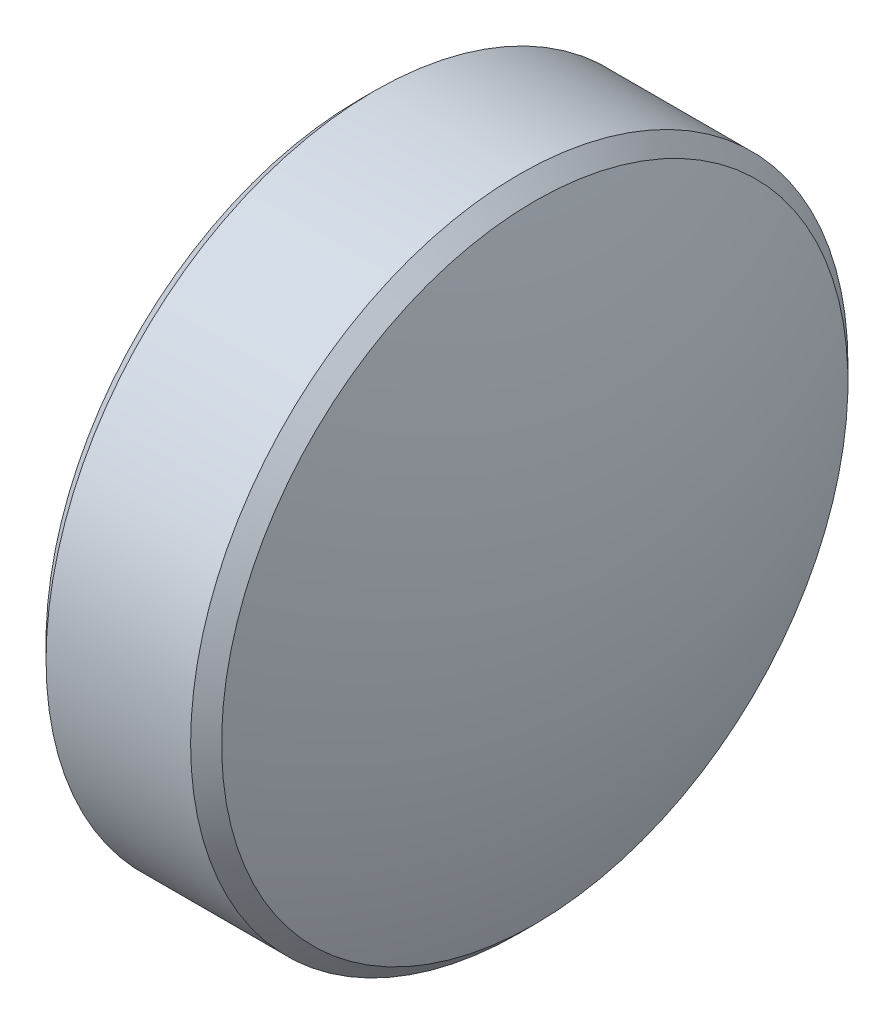
ISO-10303-21;
HEADER;
FILE_DESCRIPTION(('STEP AP214'),'2;1');
FILE_NAME('part.step','',(''),(''),'','','');
FILE_SCHEMA(('AUTOMOTIVE_DESIGN { 1 0 10303 214 1 1 1 1 }'));
ENDSEC;
DATA;
#1=APPLICATION_CONTEXT('core data for automotive mechanical design processes');
#2=APPLICATION_PROTOCOL_DEFINITION('international standard','automotive_design',2000,#1);
#3=PRODUCT_CONTEXT('',#1,'mechanical');
#4=PRODUCT('Part','Part','',(#3));
#5=PRODUCT_RELATED_PRODUCT_CATEGORY('part','',(#4));
#6=PRODUCT_DEFINITION_FORMATION('','',#4);
#7=PRODUCT_DEFINITION_CONTEXT('part definition',#1,'design');
#8=PRODUCT_DEFINITION('design','',#6,#7);
#9=PRODUCT_DEFINITION_SHAPE('','',#8);
#10=(LENGTH_UNIT() NAMED_UNIT(*) SI_UNIT(.MILLI.,.METRE.));
#11=(NAMED_UNIT(*) PLANE_ANGLE_UNIT() SI_UNIT($,.RADIAN.));
#12=(NAMED_UNIT(*) SI_UNIT($,.STERADIAN.) SOLID_ANGLE_UNIT());
#13=UNCERTAINTY_MEASURE_WITH_UNIT(LENGTH_MEASURE(1.E-05),#10,'distance_accuracy_value','');
#14=(GEOMETRIC_REPRESENTATION_CONTEXT(3) GLOBAL_UNCERTAINTY_ASSIGNED_CONTEXT((#13)) GLOBAL_UNIT_ASSIGNED_CONTEXT((#10,
#11,#12)) REPRESENTATION_CONTEXT('',''));
#15=CARTESIAN_POINT('',(0.,0.,0.));
#16=DIRECTION('',(0.,0.,1.));
#17=DIRECTION('',(1.,0.,0.));
#18=AXIS2_PLACEMENT_3D('',#15,#16,#17);
#19=CARTESIAN_POINT('',(7.49977537629818,0.0628754856546688,0.));
#20=DIRECTION('',(0.,0.,-1.));
#21=DIRECTION('',(0.,-1.,0.));
#22=AXIS2_PLACEMENT_3D('',#19,#20,#21);
#23=CIRCLE('',#22,8.8);
#24=TRIMMED_CURVE('',#23,(PARAMETER_VALUE(-1.56365132445006)),
(PARAMETER_VALUE(1.56365132445006)),.T.,.PARAMETER.);
#25=CARTESIAN_POINT('',(7.49977537629818,0.,0.));
#26=DIRECTION('',(-1.,0.,0.));
#27=AXIS1_PLACEMENT('',#25,#26);
#28=SURFACE_OF_REVOLUTION('',#24,#27);
#29=CARTESIAN_POINT('',(-1.3,0.,0.));
#30=VERTEX_POINT('',#29);
#31=VERTEX_LOOP('',#30);
#32=FACE_BOUND('',#31,.T.);
#33=CARTESIAN_POINT('',(-0.801134559950395,0.,0.));
#34=DIRECTION('',(-1.,0.,0.));
#35=DIRECTION('',(0.,-1.,0.));
#36=AXIS2_PLACEMENT_3D('',#33,#34,#35);
#37=CIRCLE('',#36,2.85857864376269);
#38=CARTESIAN_POINT('',(-0.801134559950394,-2.85857864376269,0.));
#39=VERTEX_POINT('',#38);
#40=EDGE_CURVE('E10',#39,#39,#37,.T.);
#41=ORIENTED_EDGE('',*,*,#40,.T.);
#42=EDGE_LOOP('',(#41));
#43=FACE_BOUND('',#42,.T.);
#44=ADVANCED_FACE('F15',(#32,#43),#28,.T.);
#45=CARTESIAN_POINT('',(-0.659713203713086,0.,0.));
#46=DIRECTION('',(1.,0.,0.));
#47=DIRECTION('',(0.,1.,0.));
#48=AXIS2_PLACEMENT_3D('',#45,#46,#47);
#49=CONICAL_SURFACE('',#48,3.,0.78539816339745);
#50=ORIENTED_EDGE('',*,*,#40,.F.);
#51=EDGE_LOOP('',(#50));
#52=FACE_BOUND('',#51,.T.);
#53=CARTESIAN_POINT('',(-0.659713203713086,0.,0.));
#54=DIRECTION('',(-1.,0.,0.));
#55=DIRECTION('',(0.,-1.,0.));
#56=AXIS2_PLACEMENT_3D('',#53,#54,#55);
#57=CIRCLE('',#56,3.);
#58=CARTESIAN_POINT('',(-0.659713203713085,-3.,0.));
#59=VERTEX_POINT('',#58);
#60=EDGE_CURVE('E22',#59,#59,#57,.T.);
#61=ORIENTED_EDGE('',*,*,#60,.T.);
#62=EDGE_LOOP('',(#61));
#63=FACE_BOUND('',#62,.T.);
#64=ADVANCED_FACE('F30',(#52,#63),#49,.T.);
#65=CARTESIAN_POINT('',(-1.3,0.,0.));
#66=DIRECTION('',(-1.,0.,0.));
#67=DIRECTION('',(0.,-1.,0.));
#68=AXIS2_PLACEMENT_3D('',#65,#66,#67);
#69=CYLINDRICAL_SURFACE('',#68,3.);
#70=ORIENTED_EDGE('',*,*,#60,.F.);
#71=EDGE_LOOP('',(#70));
#72=FACE_BOUND('',#71,.T.);
#73=CARTESIAN_POINT('',(0.659713203713087,0.,0.));
#74=DIRECTION('',(-1.,0.,0.));
#75=DIRECTION('',(0.,-1.,0.));
#76=AXIS2_PLACEMENT_3D('',#73,#74,#75);
#77=CIRCLE('',#76,3.);
#78=CARTESIAN_POINT('',(0.659713203713087,-3.,0.));
#79=VERTEX_POINT('',#78);
#80=EDGE_CURVE('E39',#79,#79,#77,.T.);
#81=ORIENTED_EDGE('',*,*,#80,.T.);
#82=EDGE_LOOP('',(#81));
#83=FACE_BOUND('',#82,.T.);
#84=ADVANCED_FACE('F35',(#72,#83),#69,.T.);
#85=CARTESIAN_POINT('',(0.801134559950394,0.,0.));
#86=DIRECTION('',(-1.,0.,0.));
#87=DIRECTION('',(0.,-1.,0.));
#88=AXIS2_PLACEMENT_3D('',#85,#86,#87);
#89=CONICAL_SURFACE('',#88,2.85857864376269,0.785398163397453);
#90=ORIENTED_EDGE('',*,*,#80,.F.);
#91=EDGE_LOOP('',(#90));
#92=FACE_BOUND('',#91,.T.);
#93=CARTESIAN_POINT('',(0.801134559950394,0.,0.));
#94=DIRECTION('',(-1.,0.,0.));
#95=DIRECTION('',(0.,-1.,0.));
#96=AXIS2_PLACEMENT_3D('',#93,#94,#95);
#97=CIRCLE('',#96,2.85857864376269);
#98=CARTESIAN_POINT('',(0.801134559950395,-2.85857864376269,0.));
#99=VERTEX_POINT('',#98);
#100=EDGE_CURVE('E41',#99,#99,#97,.T.);
#101=ORIENTED_EDGE('',*,*,#100,.T.);
#102=EDGE_LOOP('',(#101));
#103=FACE_BOUND('',#102,.T.);
#104=ADVANCED_FACE('F47',(#92,#103),#89,.T.);
#105=CARTESIAN_POINT('',(-7.49977537629818,0.0628754856546691,0.));
#106=DIRECTION('',(0.,0.,-1.));
#107=DIRECTION('',(0.,-1.,0.));
#108=AXIS2_PLACEMENT_3D('',#105,#106,#107);
#109=CIRCLE('',#108,8.8);
#110=TRIMMED_CURVE('',#109,(PARAMETER_VALUE(-1.56365132445006)),
(PARAMETER_VALUE(1.56365132445006)),.T.,.PARAMETER.);
#111=CARTESIAN_POINT('',(-7.49977537629818,0.,0.));
#112=DIRECTION('',(-1.,0.,0.));
#113=AXIS1_PLACEMENT('',#111,#112);
#114=SURFACE_OF_REVOLUTION('',#110,#113);
#115=ORIENTED_EDGE('',*,*,#100,.F.);
#116=EDGE_LOOP('',(#115));
#117=FACE_BOUND('',#116,.T.);
#118=CARTESIAN_POINT('',(1.3,0.,0.));
#119=VERTEX_POINT('',#118);
#120=VERTEX_LOOP('',#119);
#121=FACE_BOUND('',#120,.T.);
#122=ADVANCED_FACE('F49',(#117,#121),#114,.T.);
#123=CLOSED_SHELL('',(#44,#64,#84,#104,#122));
#124=MANIFOLD_SOLID_BREP('B1',#123);
#125=ADVANCED_BREP_SHAPE_REPRESENTATION('',(#18,#124),#14);
#126=SHAPE_DEFINITION_REPRESENTATION(#9,#125);
ENDSEC;
END-ISO-10303-21;
